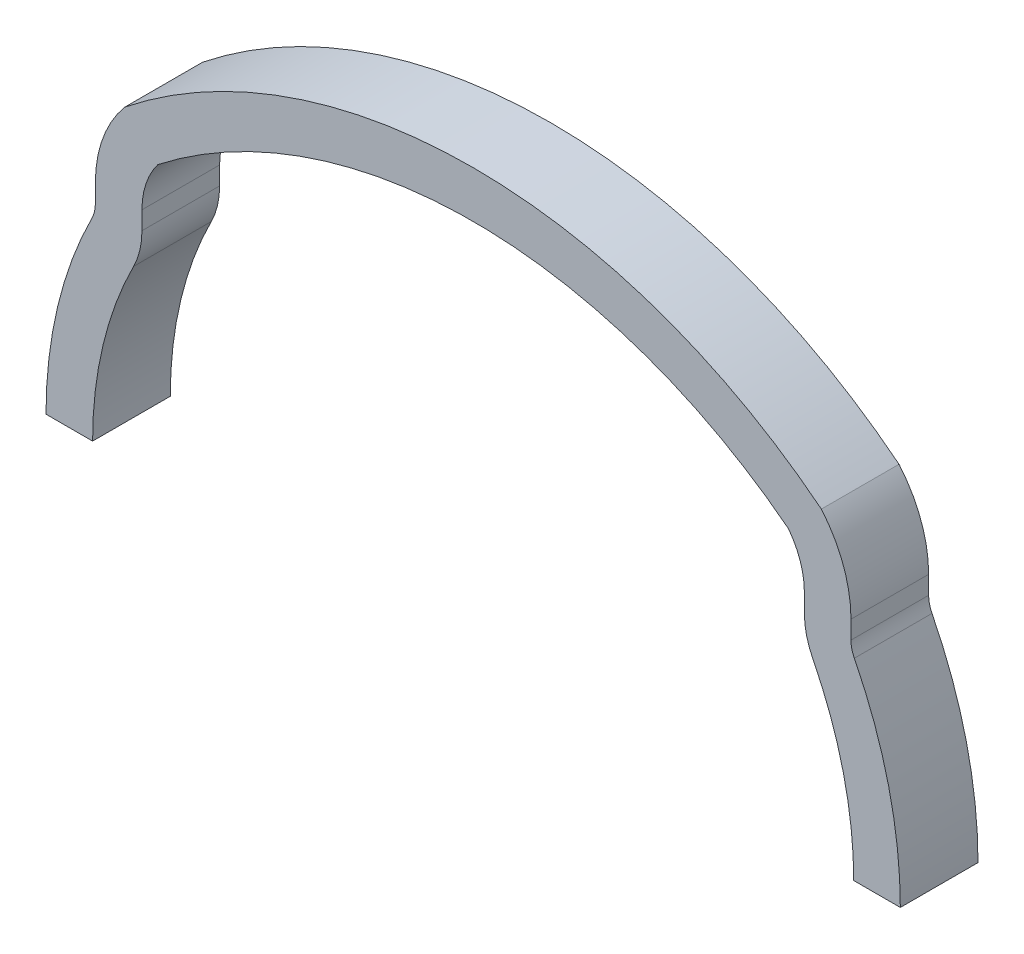
ISO-10303-21;
HEADER;
FILE_DESCRIPTION(('STEP AP214'),'2;1');
FILE_NAME('part.step','',(''),(''),'','','');
FILE_SCHEMA(('AUTOMOTIVE_DESIGN { 1 0 10303 214 1 1 1 1 }'));
ENDSEC;
DATA;
#1=APPLICATION_CONTEXT('core data for automotive mechanical design processes');
#2=APPLICATION_PROTOCOL_DEFINITION('international standard','automotive_design',2000,#1);
#3=PRODUCT_CONTEXT('',#1,'mechanical');
#4=PRODUCT('Part','Part','',(#3));
#5=PRODUCT_RELATED_PRODUCT_CATEGORY('part','',(#4));
#6=PRODUCT_DEFINITION_FORMATION('','',#4);
#7=PRODUCT_DEFINITION_CONTEXT('part definition',#1,'design');
#8=PRODUCT_DEFINITION('design','',#6,#7);
#9=PRODUCT_DEFINITION_SHAPE('','',#8);
#10=(LENGTH_UNIT() NAMED_UNIT(*) SI_UNIT(.MILLI.,.METRE.));
#11=(NAMED_UNIT(*) PLANE_ANGLE_UNIT() SI_UNIT($,.RADIAN.));
#12=(NAMED_UNIT(*) SI_UNIT($,.STERADIAN.) SOLID_ANGLE_UNIT());
#13=UNCERTAINTY_MEASURE_WITH_UNIT(LENGTH_MEASURE(1.E-05),#10,'distance_accuracy_value','');
#14=(GEOMETRIC_REPRESENTATION_CONTEXT(3) GLOBAL_UNCERTAINTY_ASSIGNED_CONTEXT((#13)) GLOBAL_UNIT_ASSIGNED_CONTEXT((#10,
#11,#12)) REPRESENTATION_CONTEXT('',''));
#15=CARTESIAN_POINT('',(0.,0.,0.));
#16=DIRECTION('',(0.,0.,1.));
#17=DIRECTION('',(1.,0.,0.));
#18=AXIS2_PLACEMENT_3D('',#15,#16,#17);
#19=CARTESIAN_POINT('',(16.3230769230769,14.4852505589068,5.));
#20=DIRECTION('',(0.,0.,-1.));
#21=DIRECTION('',(-1.,0.,0.));
#22=AXIS2_PLACEMENT_3D('',#19,#20,#21);
#23=CYLINDRICAL_SURFACE('',#22,7.99999999999999);
#24=CARTESIAN_POINT('',(16.3230769230769,14.4852505589068,0.));
#25=DIRECTION('',(0.,0.,1.));
#26=DIRECTION('',(-1.,0.,0.));
#27=AXIS2_PLACEMENT_3D('',#24,#25,#26);
#28=CIRCLE('',#27,7.99999999999999);
#29=CARTESIAN_POINT('',(24.3230769230769,14.4852505589068,0.));
#30=VERTEX_POINT('',#29);
#31=CARTESIAN_POINT('',(22.4158573499299,19.6696528070119,0.));
#32=VERTEX_POINT('',#31);
#33=EDGE_CURVE('E212',#30,#32,#28,.T.);
#34=ORIENTED_EDGE('',*,*,#33,.T.);
#35=DIRECTION('',(0.,0.,-1.));
#36=VECTOR('',#35,1.);
#37=CARTESIAN_POINT('',(22.4158573499299,19.6696528070119,5.));
#38=LINE('',#37,#36);
#39=CARTESIAN_POINT('',(22.4158573499299,19.6696528070119,5.));
#40=VERTEX_POINT('',#39);
#41=EDGE_CURVE('E11',#40,#32,#38,.T.);
#42=ORIENTED_EDGE('',*,*,#41,.F.);
#43=CARTESIAN_POINT('',(16.3230769230769,14.4852505589068,5.));
#44=DIRECTION('',(0.,0.,1.));
#45=DIRECTION('',(-1.,0.,0.));
#46=AXIS2_PLACEMENT_3D('',#43,#44,#45);
#47=CIRCLE('',#46,7.99999999999999);
#48=CARTESIAN_POINT('',(24.3230769230769,14.4852505589068,5.));
#49=VERTEX_POINT('',#48);
#50=EDGE_CURVE('E271',#49,#40,#47,.T.);
#51=ORIENTED_EDGE('',*,*,#50,.F.);
#52=DIRECTION('',(0.,0.,-1.));
#53=VECTOR('',#52,1.);
#54=CARTESIAN_POINT('',(24.3230769230769,14.4852505589068,5.));
#55=LINE('',#54,#53);
#56=EDGE_CURVE('E208',#49,#30,#55,.T.);
#57=ORIENTED_EDGE('',*,*,#56,.T.);
#58=EDGE_LOOP('',(#34,#42,#51,#57));
#59=FACE_BOUND('',#58,.T.);
#60=ADVANCED_FACE('F39',(#59),#23,.T.);
#61=CARTESIAN_POINT('',(0.,-8.5,5.));
#62=DIRECTION('',(0.,0.,-1.));
#63=DIRECTION('',(-1.,0.,0.));
#64=AXIS2_PLACEMENT_3D('',#61,#62,#63);
#65=CYLINDRICAL_SURFACE('',#64,36.);
#66=CARTESIAN_POINT('',(0.,-8.5,0.));
#67=DIRECTION('',(0.,0.,1.));
#68=DIRECTION('',(1.,0.,0.));
#69=AXIS2_PLACEMENT_3D('',#66,#67,#68);
#70=CIRCLE('',#69,36.);
#71=CARTESIAN_POINT('',(-22.4158573499299,19.6696528070119,0.));
#72=VERTEX_POINT('',#71);
#73=EDGE_CURVE('E216',#32,#72,#70,.T.);
#74=ORIENTED_EDGE('',*,*,#73,.T.);
#75=DIRECTION('',(0.,0.,-1.));
#76=VECTOR('',#75,1.);
#77=CARTESIAN_POINT('',(-22.4158573499299,19.6696528070119,5.));
#78=LINE('',#77,#76);
#79=CARTESIAN_POINT('',(-22.4158573499299,19.6696528070119,5.));
#80=VERTEX_POINT('',#79);
#81=EDGE_CURVE('E48',#80,#72,#78,.T.);
#82=ORIENTED_EDGE('',*,*,#81,.F.);
#83=CARTESIAN_POINT('',(0.,-8.5,5.));
#84=DIRECTION('',(0.,0.,1.));
#85=DIRECTION('',(-1.,0.,0.));
#86=AXIS2_PLACEMENT_3D('',#83,#84,#85);
#87=CIRCLE('',#86,36.);
#88=EDGE_CURVE('E135',#40,#80,#87,.T.);
#89=ORIENTED_EDGE('',*,*,#88,.F.);
#90=ORIENTED_EDGE('',*,*,#41,.T.);
#91=EDGE_LOOP('',(#74,#82,#89,#90));
#92=FACE_BOUND('',#91,.T.);
#93=ADVANCED_FACE('F421',(#92),#65,.T.);
#94=CARTESIAN_POINT('',(-16.3230769230769,14.4852505589068,5.));
#95=DIRECTION('',(0.,0.,-1.));
#96=DIRECTION('',(-1.,0.,0.));
#97=AXIS2_PLACEMENT_3D('',#94,#95,#96);
#98=CYLINDRICAL_SURFACE('',#97,7.99999999999999);
#99=CARTESIAN_POINT('',(-16.3230769230769,14.4852505589068,0.));
#100=DIRECTION('',(0.,0.,1.));
#101=DIRECTION('',(1.,0.,0.));
#102=AXIS2_PLACEMENT_3D('',#99,#100,#101);
#103=CIRCLE('',#102,7.99999999999999);
#104=CARTESIAN_POINT('',(-24.3230769230769,14.4852505589068,0.));
#105=VERTEX_POINT('',#104);
#106=EDGE_CURVE('E219',#72,#105,#103,.T.);
#107=ORIENTED_EDGE('',*,*,#106,.T.);
#108=DIRECTION('',(0.,0.,-1.));
#109=VECTOR('',#108,1.);
#110=CARTESIAN_POINT('',(-24.3230769230769,14.4852505589068,5.));
#111=LINE('',#110,#109);
#112=CARTESIAN_POINT('',(-24.3230769230769,14.4852505589068,5.));
#113=VERTEX_POINT('',#112);
#114=EDGE_CURVE('E330',#113,#105,#111,.T.);
#115=ORIENTED_EDGE('',*,*,#114,.F.);
#116=CARTESIAN_POINT('',(-16.3230769230769,14.4852505589068,5.));
#117=DIRECTION('',(0.,0.,1.));
#118=DIRECTION('',(1.,0.,0.));
#119=AXIS2_PLACEMENT_3D('',#116,#117,#118);
#120=CIRCLE('',#119,7.99999999999999);
#121=EDGE_CURVE('E340',#80,#113,#120,.T.);
#122=ORIENTED_EDGE('',*,*,#121,.F.);
#123=ORIENTED_EDGE('',*,*,#81,.T.);
#124=EDGE_LOOP('',(#107,#115,#122,#123));
#125=FACE_BOUND('',#124,.T.);
#126=ADVANCED_FACE('F338',(#125),#98,.T.);
#127=CARTESIAN_POINT('',(-24.3230769230769,14.4852505589068,5.));
#128=DIRECTION('',(1.,0.,0.));
#129=DIRECTION('',(0.,1.,0.));
#130=AXIS2_PLACEMENT_3D('',#127,#128,#129);
#131=PLANE('',#130);
#132=DIRECTION('',(0.,-1.,0.));
#133=VECTOR('',#132,1.);
#134=CARTESIAN_POINT('',(-24.3230769230769,14.4852505589068,0.));
#135=LINE('',#134,#133);
#136=CARTESIAN_POINT('',(-24.3230769230769,13.3171176048639,0.));
#137=VERTEX_POINT('',#136);
#138=EDGE_CURVE('E222',#105,#137,#135,.T.);
#139=ORIENTED_EDGE('',*,*,#138,.T.);
#140=DIRECTION('',(0.,0.,-1.));
#141=VECTOR('',#140,1.);
#142=CARTESIAN_POINT('',(-24.3230769230769,13.3171176048639,5.));
#143=LINE('',#142,#141);
#144=CARTESIAN_POINT('',(-24.3230769230769,13.3171176048639,5.));
#145=VERTEX_POINT('',#144);
#146=EDGE_CURVE('E326',#145,#137,#143,.T.);
#147=ORIENTED_EDGE('',*,*,#146,.F.);
#148=DIRECTION('',(0.,-1.,0.));
#149=VECTOR('',#148,1.);
#150=CARTESIAN_POINT('',(-24.3230769230769,14.4852505589068,5.));
#151=LINE('',#150,#149);
#152=EDGE_CURVE('E359',#113,#145,#151,.T.);
#153=ORIENTED_EDGE('',*,*,#152,.F.);
#154=ORIENTED_EDGE('',*,*,#114,.T.);
#155=EDGE_LOOP('',(#139,#147,#153,#154));
#156=FACE_BOUND('',#155,.T.);
#157=ADVANCED_FACE('F349',(#156),#131,.F.);
#158=CARTESIAN_POINT('',(-26.3230769230769,13.3171176048639,5.));
#159=DIRECTION('',(0.,0.,-1.));
#160=DIRECTION('',(-1.,0.,0.));
#161=AXIS2_PLACEMENT_3D('',#158,#159,#160);
#162=CYLINDRICAL_SURFACE('',#161,2.);
#163=CARTESIAN_POINT('',(-26.3230769230769,13.3171176048639,0.));
#164=DIRECTION('',(0.,0.,-1.));
#165=DIRECTION('',(-1.,0.,0.));
#166=AXIS2_PLACEMENT_3D('',#163,#164,#165);
#167=CIRCLE('',#166,2.);
#168=CARTESIAN_POINT('',(-24.5384615384616,12.4142621740256,0.));
#169=VERTEX_POINT('',#168);
#170=EDGE_CURVE('E225',#137,#169,#167,.T.);
#171=ORIENTED_EDGE('',*,*,#170,.T.);
#172=DIRECTION('',(0.,0.,-1.));
#173=VECTOR('',#172,1.);
#174=CARTESIAN_POINT('',(-24.5384615384616,12.4142621740256,5.));
#175=LINE('',#174,#173);
#176=CARTESIAN_POINT('',(-24.5384615384616,12.4142621740256,5.));
#177=VERTEX_POINT('',#176);
#178=EDGE_CURVE('E322',#177,#169,#175,.T.);
#179=ORIENTED_EDGE('',*,*,#178,.F.);
#180=CARTESIAN_POINT('',(-26.3230769230769,13.3171176048639,5.));
#181=DIRECTION('',(0.,0.,-1.));
#182=DIRECTION('',(-1.,0.,0.));
#183=AXIS2_PLACEMENT_3D('',#180,#181,#182);
#184=CIRCLE('',#183,2.);
#185=EDGE_CURVE('E355',#145,#177,#184,.T.);
#186=ORIENTED_EDGE('',*,*,#185,.F.);
#187=ORIENTED_EDGE('',*,*,#146,.T.);
#188=EDGE_LOOP('',(#171,#179,#186,#187));
#189=FACE_BOUND('',#188,.T.);
#190=ADVANCED_FACE('F353',(#189),#162,.F.);
#191=CARTESIAN_POINT('',(0.,0.,5.));
#192=DIRECTION('',(0.,0.,-1.));
#193=DIRECTION('',(-1.,0.,0.));
#194=AXIS2_PLACEMENT_3D('',#191,#192,#193);
#195=CYLINDRICAL_SURFACE('',#194,27.5);
#196=CARTESIAN_POINT('',(0.,0.,0.));
#197=DIRECTION('',(0.,0.,1.));
#198=DIRECTION('',(1.,0.,0.));
#199=AXIS2_PLACEMENT_3D('',#196,#197,#198);
#200=CIRCLE('',#199,27.5);
#201=CARTESIAN_POINT('',(-27.5,0.,0.));
#202=VERTEX_POINT('',#201);
#203=EDGE_CURVE('E228',#169,#202,#200,.T.);
#204=ORIENTED_EDGE('',*,*,#203,.T.);
#205=DIRECTION('',(0.,0.,-1.));
#206=VECTOR('',#205,1.);
#207=CARTESIAN_POINT('',(-27.5,0.,5.));
#208=LINE('',#207,#206);
#209=CARTESIAN_POINT('',(-27.5,0.,5.));
#210=VERTEX_POINT('',#209);
#211=EDGE_CURVE('E318',#210,#202,#208,.T.);
#212=ORIENTED_EDGE('',*,*,#211,.F.);
#213=CARTESIAN_POINT('',(0.,0.,5.));
#214=DIRECTION('',(0.,0.,1.));
#215=DIRECTION('',(1.,0.,0.));
#216=AXIS2_PLACEMENT_3D('',#213,#214,#215);
#217=CIRCLE('',#216,27.5);
#218=EDGE_CURVE('E358',#177,#210,#217,.T.);
#219=ORIENTED_EDGE('',*,*,#218,.F.);
#220=ORIENTED_EDGE('',*,*,#178,.T.);
#221=EDGE_LOOP('',(#204,#212,#219,#220));
#222=FACE_BOUND('',#221,.T.);
#223=ADVANCED_FACE('F434',(#222),#195,.T.);
#224=CARTESIAN_POINT('',(-27.5,0.,5.));
#225=DIRECTION('',(0.,1.,0.));
#226=DIRECTION('',(-1.,0.,0.));
#227=AXIS2_PLACEMENT_3D('',#224,#225,#226);
#228=PLANE('',#227);
#229=DIRECTION('',(1.,0.,0.));
#230=VECTOR('',#229,1.);
#231=CARTESIAN_POINT('',(-27.5,0.,0.));
#232=LINE('',#231,#230);
#233=CARTESIAN_POINT('',(-24.5,0.,0.));
#234=VERTEX_POINT('',#233);
#235=EDGE_CURVE('E231',#202,#234,#232,.T.);
#236=ORIENTED_EDGE('',*,*,#235,.T.);
#237=DIRECTION('',(0.,0.,-1.));
#238=VECTOR('',#237,1.);
#239=CARTESIAN_POINT('',(-24.5,0.,5.));
#240=LINE('',#239,#238);
#241=CARTESIAN_POINT('',(-24.5,0.,5.));
#242=VERTEX_POINT('',#241);
#243=EDGE_CURVE('E314',#242,#234,#240,.T.);
#244=ORIENTED_EDGE('',*,*,#243,.F.);
#245=DIRECTION('',(1.,0.,0.));
#246=VECTOR('',#245,1.);
#247=CARTESIAN_POINT('',(-27.5,0.,5.));
#248=LINE('',#247,#246);
#249=EDGE_CURVE('E363',#210,#242,#248,.T.);
#250=ORIENTED_EDGE('',*,*,#249,.F.);
#251=ORIENTED_EDGE('',*,*,#211,.T.);
#252=EDGE_LOOP('',(#236,#244,#250,#251));
#253=FACE_BOUND('',#252,.T.);
#254=ADVANCED_FACE('F437',(#253),#228,.F.);
#255=CARTESIAN_POINT('',(0.,0.,5.));
#256=DIRECTION('',(0.,0.,-1.));
#257=DIRECTION('',(-1.,0.,0.));
#258=AXIS2_PLACEMENT_3D('',#255,#256,#257);
#259=CYLINDRICAL_SURFACE('',#258,24.5);
#260=CARTESIAN_POINT('',(0.,0.,0.));
#261=DIRECTION('',(0.,0.,-1.));
#262=DIRECTION('',(1.,0.,0.));
#263=AXIS2_PLACEMENT_3D('',#260,#261,#262);
#264=CIRCLE('',#263,24.5);
#265=CARTESIAN_POINT('',(-21.8615384615385,11.0599790277683,0.));
#266=VERTEX_POINT('',#265);
#267=EDGE_CURVE('E234',#234,#266,#264,.T.);
#268=ORIENTED_EDGE('',*,*,#267,.T.);
#269=DIRECTION('',(0.,0.,-1.));
#270=VECTOR('',#269,1.);
#271=CARTESIAN_POINT('',(-21.8615384615385,11.0599790277683,5.));
#272=LINE('',#271,#270);
#273=CARTESIAN_POINT('',(-21.8615384615385,11.0599790277683,5.));
#274=VERTEX_POINT('',#273);
#275=EDGE_CURVE('E310',#274,#266,#272,.T.);
#276=ORIENTED_EDGE('',*,*,#275,.F.);
#277=CARTESIAN_POINT('',(0.,0.,5.));
#278=DIRECTION('',(0.,0.,-1.));
#279=DIRECTION('',(1.,0.,0.));
#280=AXIS2_PLACEMENT_3D('',#277,#278,#279);
#281=CIRCLE('',#280,24.5);
#282=EDGE_CURVE('E370',#242,#274,#281,.T.);
#283=ORIENTED_EDGE('',*,*,#282,.F.);
#284=ORIENTED_EDGE('',*,*,#243,.T.);
#285=EDGE_LOOP('',(#268,#276,#283,#284));
#286=FACE_BOUND('',#285,.T.);
#287=ADVANCED_FACE('F441',(#286),#259,.F.);
#288=CARTESIAN_POINT('',(-26.3230769230769,13.3171176048639,5.));
#289=DIRECTION('',(0.,0.,-1.));
#290=DIRECTION('',(-1.,0.,0.));
#291=AXIS2_PLACEMENT_3D('',#288,#289,#290);
#292=CYLINDRICAL_SURFACE('',#291,5.);
#293=CARTESIAN_POINT('',(-26.3230769230769,13.3171176048639,0.));
#294=DIRECTION('',(0.,0.,1.));
#295=DIRECTION('',(-1.,0.,0.));
#296=AXIS2_PLACEMENT_3D('',#293,#294,#295);
#297=CIRCLE('',#296,5.);
#298=CARTESIAN_POINT('',(-21.3230769230769,13.3171176048639,0.));
#299=VERTEX_POINT('',#298);
#300=EDGE_CURVE('E237',#266,#299,#297,.T.);
#301=ORIENTED_EDGE('',*,*,#300,.T.);
#302=DIRECTION('',(0.,0.,-1.));
#303=VECTOR('',#302,1.);
#304=CARTESIAN_POINT('',(-21.3230769230769,13.3171176048639,5.));
#305=LINE('',#304,#303);
#306=CARTESIAN_POINT('',(-21.3230769230769,13.3171176048639,5.));
#307=VERTEX_POINT('',#306);
#308=EDGE_CURVE('E306',#307,#299,#305,.T.);
#309=ORIENTED_EDGE('',*,*,#308,.F.);
#310=CARTESIAN_POINT('',(-26.3230769230769,13.3171176048639,5.));
#311=DIRECTION('',(0.,0.,1.));
#312=DIRECTION('',(-1.,0.,0.));
#313=AXIS2_PLACEMENT_3D('',#310,#311,#312);
#314=CIRCLE('',#313,5.);
#315=EDGE_CURVE('E373',#274,#307,#314,.T.);
#316=ORIENTED_EDGE('',*,*,#315,.F.);
#317=ORIENTED_EDGE('',*,*,#275,.T.);
#318=EDGE_LOOP('',(#301,#309,#316,#317));
#319=FACE_BOUND('',#318,.T.);
#320=ADVANCED_FACE('F445',(#319),#292,.T.);
#321=CARTESIAN_POINT('',(-21.3230769230769,14.4852505589068,5.));
#322=DIRECTION('',(-1.,0.,0.));
#323=DIRECTION('',(0.,-1.,0.));
#324=AXIS2_PLACEMENT_3D('',#321,#322,#323);
#325=PLANE('',#324);
#326=DIRECTION('',(0.,1.,0.));
#327=VECTOR('',#326,1.);
#328=CARTESIAN_POINT('',(-21.3230769230769,14.4852505589068,0.));
#329=LINE('',#328,#327);
#330=CARTESIAN_POINT('',(-21.3230769230769,14.4852505589068,0.));
#331=VERTEX_POINT('',#330);
#332=EDGE_CURVE('E240',#299,#331,#329,.T.);
#333=ORIENTED_EDGE('',*,*,#332,.T.);
#334=DIRECTION('',(0.,0.,-1.));
#335=VECTOR('',#334,1.);
#336=CARTESIAN_POINT('',(-21.3230769230769,14.4852505589068,5.));
#337=LINE('',#336,#335);
#338=CARTESIAN_POINT('',(-21.3230769230769,14.4852505589068,5.));
#339=VERTEX_POINT('',#338);
#340=EDGE_CURVE('E302',#339,#331,#337,.T.);
#341=ORIENTED_EDGE('',*,*,#340,.F.);
#342=DIRECTION('',(0.,1.,0.));
#343=VECTOR('',#342,1.);
#344=CARTESIAN_POINT('',(-21.3230769230769,14.4852505589068,5.));
#345=LINE('',#344,#343);
#346=EDGE_CURVE('E376',#307,#339,#345,.T.);
#347=ORIENTED_EDGE('',*,*,#346,.F.);
#348=ORIENTED_EDGE('',*,*,#308,.T.);
#349=EDGE_LOOP('',(#333,#341,#347,#348));
#350=FACE_BOUND('',#349,.T.);
#351=ADVANCED_FACE('F449',(#350),#325,.F.);
#352=CARTESIAN_POINT('',(-16.3230769230769,14.4852505589068,5.));
#353=DIRECTION('',(0.,0.,-1.));
#354=DIRECTION('',(-1.,0.,0.));
#355=AXIS2_PLACEMENT_3D('',#352,#353,#354);
#356=CYLINDRICAL_SURFACE('',#355,5.);
#357=CARTESIAN_POINT('',(-16.3230769230769,14.4852505589068,0.));
#358=DIRECTION('',(0.,0.,-1.));
#359=DIRECTION('',(1.,0.,0.));
#360=AXIS2_PLACEMENT_3D('',#357,#358,#359);
#361=CIRCLE('',#360,5.);
#362=CARTESIAN_POINT('',(-20.2967620018153,17.5200202198551,0.));
#363=VERTEX_POINT('',#362);
#364=EDGE_CURVE('E243',#331,#363,#361,.T.);
#365=ORIENTED_EDGE('',*,*,#364,.T.);
#366=DIRECTION('',(0.,0.,-1.));
#367=VECTOR('',#366,1.);
#368=CARTESIAN_POINT('',(-20.2967620018153,17.5200202198551,5.));
#369=LINE('',#368,#367);
#370=CARTESIAN_POINT('',(-20.2967620018153,17.5200202198551,5.));
#371=VERTEX_POINT('',#370);
#372=EDGE_CURVE('E298',#371,#363,#369,.T.);
#373=ORIENTED_EDGE('',*,*,#372,.F.);
#374=CARTESIAN_POINT('',(-16.3230769230769,14.4852505589068,5.));
#375=DIRECTION('',(0.,0.,-1.));
#376=DIRECTION('',(1.,0.,0.));
#377=AXIS2_PLACEMENT_3D('',#374,#375,#376);
#378=CIRCLE('',#377,5.);
#379=EDGE_CURVE('E379',#339,#371,#378,.T.);
#380=ORIENTED_EDGE('',*,*,#379,.F.);
#381=ORIENTED_EDGE('',*,*,#340,.T.);
#382=EDGE_LOOP('',(#365,#373,#380,#381));
#383=FACE_BOUND('',#382,.T.);
#384=ADVANCED_FACE('F453',(#383),#356,.F.);
#385=CARTESIAN_POINT('',(0.,-8.5,5.));
#386=DIRECTION('',(0.,0.,-1.));
#387=DIRECTION('',(-1.,0.,0.));
#388=AXIS2_PLACEMENT_3D('',#385,#386,#387);
#389=CYLINDRICAL_SURFACE('',#388,33.);
#390=CARTESIAN_POINT('',(0.,-8.5,0.));
#391=DIRECTION('',(0.,0.,-1.));
#392=DIRECTION('',(-1.,0.,0.));
#393=AXIS2_PLACEMENT_3D('',#390,#391,#392);
#394=CIRCLE('',#393,33.);
#395=CARTESIAN_POINT('',(20.2967620018153,17.5200202198551,0.));
#396=VERTEX_POINT('',#395);
#397=EDGE_CURVE('E247',#363,#396,#394,.T.);
#398=ORIENTED_EDGE('',*,*,#397,.T.);
#399=DIRECTION('',(0.,0.,-1.));
#400=VECTOR('',#399,1.);
#401=CARTESIAN_POINT('',(20.2967620018153,17.5200202198551,5.));
#402=LINE('',#401,#400);
#403=CARTESIAN_POINT('',(20.2967620018153,17.5200202198551,5.));
#404=VERTEX_POINT('',#403);
#405=EDGE_CURVE('E294',#404,#396,#402,.T.);
#406=ORIENTED_EDGE('',*,*,#405,.F.);
#407=CARTESIAN_POINT('',(0.,-8.5,5.));
#408=DIRECTION('',(0.,0.,-1.));
#409=DIRECTION('',(1.,0.,0.));
#410=AXIS2_PLACEMENT_3D('',#407,#408,#409);
#411=CIRCLE('',#410,33.);
#412=EDGE_CURVE('E382',#371,#404,#411,.T.);
#413=ORIENTED_EDGE('',*,*,#412,.F.);
#414=ORIENTED_EDGE('',*,*,#372,.T.);
#415=EDGE_LOOP('',(#398,#406,#413,#414));
#416=FACE_BOUND('',#415,.T.);
#417=ADVANCED_FACE('F457',(#416),#389,.F.);
#418=CARTESIAN_POINT('',(16.3230769230769,14.4852505589068,5.));
#419=DIRECTION('',(0.,0.,-1.));
#420=DIRECTION('',(-1.,0.,0.));
#421=AXIS2_PLACEMENT_3D('',#418,#419,#420);
#422=CYLINDRICAL_SURFACE('',#421,5.);
#423=CARTESIAN_POINT('',(16.3230769230769,14.4852505589068,0.));
#424=DIRECTION('',(0.,0.,-1.));
#425=DIRECTION('',(-1.,0.,0.));
#426=AXIS2_PLACEMENT_3D('',#423,#424,#425);
#427=CIRCLE('',#426,5.);
#428=CARTESIAN_POINT('',(21.3230769230769,14.4852505589068,0.));
#429=VERTEX_POINT('',#428);
#430=EDGE_CURVE('E250',#396,#429,#427,.T.);
#431=ORIENTED_EDGE('',*,*,#430,.T.);
#432=DIRECTION('',(0.,0.,-1.));
#433=VECTOR('',#432,1.);
#434=CARTESIAN_POINT('',(21.3230769230769,14.4852505589068,5.));
#435=LINE('',#434,#433);
#436=CARTESIAN_POINT('',(21.3230769230769,14.4852505589068,5.));
#437=VERTEX_POINT('',#436);
#438=EDGE_CURVE('E290',#437,#429,#435,.T.);
#439=ORIENTED_EDGE('',*,*,#438,.F.);
#440=CARTESIAN_POINT('',(16.3230769230769,14.4852505589068,5.));
#441=DIRECTION('',(0.,0.,-1.));
#442=DIRECTION('',(-1.,0.,0.));
#443=AXIS2_PLACEMENT_3D('',#440,#441,#442);
#444=CIRCLE('',#443,5.);
#445=EDGE_CURVE('E385',#404,#437,#444,.T.);
#446=ORIENTED_EDGE('',*,*,#445,.F.);
#447=ORIENTED_EDGE('',*,*,#405,.T.);
#448=EDGE_LOOP('',(#431,#439,#446,#447));
#449=FACE_BOUND('',#448,.T.);
#450=ADVANCED_FACE('F461',(#449),#422,.F.);
#451=CARTESIAN_POINT('',(21.3230769230769,14.4852505589068,5.));
#452=DIRECTION('',(1.,0.,0.));
#453=DIRECTION('',(0.,1.,0.));
#454=AXIS2_PLACEMENT_3D('',#451,#452,#453);
#455=PLANE('',#454);
#456=DIRECTION('',(0.,-1.,0.));
#457=VECTOR('',#456,1.);
#458=CARTESIAN_POINT('',(21.3230769230769,14.4852505589068,0.));
#459=LINE('',#458,#457);
#460=CARTESIAN_POINT('',(21.3230769230769,13.3171176048639,0.));
#461=VERTEX_POINT('',#460);
#462=EDGE_CURVE('E253',#429,#461,#459,.T.);
#463=ORIENTED_EDGE('',*,*,#462,.T.);
#464=DIRECTION('',(0.,0.,-1.));
#465=VECTOR('',#464,1.);
#466=CARTESIAN_POINT('',(21.3230769230769,13.3171176048639,5.));
#467=LINE('',#466,#465);
#468=CARTESIAN_POINT('',(21.3230769230769,13.3171176048639,5.));
#469=VERTEX_POINT('',#468);
#470=EDGE_CURVE('E286',#469,#461,#467,.T.);
#471=ORIENTED_EDGE('',*,*,#470,.F.);
#472=DIRECTION('',(0.,-1.,0.));
#473=VECTOR('',#472,1.);
#474=CARTESIAN_POINT('',(21.3230769230769,14.4852505589068,5.));
#475=LINE('',#474,#473);
#476=EDGE_CURVE('E388',#437,#469,#475,.T.);
#477=ORIENTED_EDGE('',*,*,#476,.F.);
#478=ORIENTED_EDGE('',*,*,#438,.T.);
#479=EDGE_LOOP('',(#463,#471,#477,#478));
#480=FACE_BOUND('',#479,.T.);
#481=ADVANCED_FACE('F465',(#480),#455,.F.);
#482=CARTESIAN_POINT('',(26.3230769230769,13.3171176048639,5.));
#483=DIRECTION('',(0.,0.,-1.));
#484=DIRECTION('',(-1.,0.,0.));
#485=AXIS2_PLACEMENT_3D('',#482,#483,#484);
#486=CYLINDRICAL_SURFACE('',#485,5.);
#487=CARTESIAN_POINT('',(26.3230769230769,13.3171176048639,0.));
#488=DIRECTION('',(0.,0.,1.));
#489=DIRECTION('',(1.,0.,0.));
#490=AXIS2_PLACEMENT_3D('',#487,#488,#489);
#491=CIRCLE('',#490,5.);
#492=CARTESIAN_POINT('',(21.8615384615385,11.0599790277683,0.));
#493=VERTEX_POINT('',#492);
#494=EDGE_CURVE('E256',#461,#493,#491,.T.);
#495=ORIENTED_EDGE('',*,*,#494,.T.);
#496=DIRECTION('',(0.,0.,-1.));
#497=VECTOR('',#496,1.);
#498=CARTESIAN_POINT('',(21.8615384615385,11.0599790277683,5.));
#499=LINE('',#498,#497);
#500=CARTESIAN_POINT('',(21.8615384615385,11.0599790277683,5.));
#501=VERTEX_POINT('',#500);
#502=EDGE_CURVE('E282',#501,#493,#499,.T.);
#503=ORIENTED_EDGE('',*,*,#502,.F.);
#504=CARTESIAN_POINT('',(26.3230769230769,13.3171176048639,5.));
#505=DIRECTION('',(0.,0.,1.));
#506=DIRECTION('',(1.,0.,0.));
#507=AXIS2_PLACEMENT_3D('',#504,#505,#506);
#508=CIRCLE('',#507,5.);
#509=EDGE_CURVE('E391',#469,#501,#508,.T.);
#510=ORIENTED_EDGE('',*,*,#509,.F.);
#511=ORIENTED_EDGE('',*,*,#470,.T.);
#512=EDGE_LOOP('',(#495,#503,#510,#511));
#513=FACE_BOUND('',#512,.T.);
#514=ADVANCED_FACE('F469',(#513),#486,.T.);
#515=CARTESIAN_POINT('',(0.,0.,5.));
#516=DIRECTION('',(0.,0.,-1.));
#517=DIRECTION('',(-1.,0.,0.));
#518=AXIS2_PLACEMENT_3D('',#515,#516,#517);
#519=CYLINDRICAL_SURFACE('',#518,24.5);
#520=CARTESIAN_POINT('',(0.,0.,0.));
#521=DIRECTION('',(0.,0.,-1.));
#522=DIRECTION('',(-1.,0.,0.));
#523=AXIS2_PLACEMENT_3D('',#520,#521,#522);
#524=CIRCLE('',#523,24.5);
#525=CARTESIAN_POINT('',(24.5,0.,0.));
#526=VERTEX_POINT('',#525);
#527=EDGE_CURVE('E259',#493,#526,#524,.T.);
#528=ORIENTED_EDGE('',*,*,#527,.T.);
#529=DIRECTION('',(0.,0.,-1.));
#530=VECTOR('',#529,1.);
#531=CARTESIAN_POINT('',(24.5,0.,5.));
#532=LINE('',#531,#530);
#533=CARTESIAN_POINT('',(24.5,0.,5.));
#534=VERTEX_POINT('',#533);
#535=EDGE_CURVE('E278',#534,#526,#532,.T.);
#536=ORIENTED_EDGE('',*,*,#535,.F.);
#537=CARTESIAN_POINT('',(0.,0.,5.));
#538=DIRECTION('',(0.,0.,-1.));
#539=DIRECTION('',(-1.,0.,0.));
#540=AXIS2_PLACEMENT_3D('',#537,#538,#539);
#541=CIRCLE('',#540,24.5);
#542=EDGE_CURVE('E394',#501,#534,#541,.T.);
#543=ORIENTED_EDGE('',*,*,#542,.F.);
#544=ORIENTED_EDGE('',*,*,#502,.T.);
#545=EDGE_LOOP('',(#528,#536,#543,#544));
#546=FACE_BOUND('',#545,.T.);
#547=ADVANCED_FACE('F402',(#546),#519,.F.);
#548=CARTESIAN_POINT('',(27.5,0.,5.));
#549=DIRECTION('',(0.,1.,0.));
#550=DIRECTION('',(-1.,0.,0.));
#551=AXIS2_PLACEMENT_3D('',#548,#549,#550);
#552=PLANE('',#551);
#553=DIRECTION('',(1.,0.,0.));
#554=VECTOR('',#553,1.);
#555=CARTESIAN_POINT('',(27.5,0.,0.));
#556=LINE('',#555,#554);
#557=CARTESIAN_POINT('',(27.5,0.,0.));
#558=VERTEX_POINT('',#557);
#559=EDGE_CURVE('E262',#526,#558,#556,.T.);
#560=ORIENTED_EDGE('',*,*,#559,.T.);
#561=DIRECTION('',(0.,0.,-1.));
#562=VECTOR('',#561,1.);
#563=CARTESIAN_POINT('',(27.5,0.,5.));
#564=LINE('',#563,#562);
#565=CARTESIAN_POINT('',(27.5,0.,5.));
#566=VERTEX_POINT('',#565);
#567=EDGE_CURVE('E201',#566,#558,#564,.T.);
#568=ORIENTED_EDGE('',*,*,#567,.F.);
#569=DIRECTION('',(1.,0.,0.));
#570=VECTOR('',#569,1.);
#571=CARTESIAN_POINT('',(27.5,0.,5.));
#572=LINE('',#571,#570);
#573=EDGE_CURVE('E190',#534,#566,#572,.T.);
#574=ORIENTED_EDGE('',*,*,#573,.F.);
#575=ORIENTED_EDGE('',*,*,#535,.T.);
#576=EDGE_LOOP('',(#560,#568,#574,#575));
#577=FACE_BOUND('',#576,.T.);
#578=ADVANCED_FACE('F406',(#577),#552,.F.);
#579=CARTESIAN_POINT('',(0.,0.,5.));
#580=DIRECTION('',(0.,0.,-1.));
#581=DIRECTION('',(-1.,0.,0.));
#582=AXIS2_PLACEMENT_3D('',#579,#580,#581);
#583=CYLINDRICAL_SURFACE('',#582,27.5);
#584=CARTESIAN_POINT('',(0.,0.,0.));
#585=DIRECTION('',(0.,0.,1.));
#586=DIRECTION('',(-1.,0.,0.));
#587=AXIS2_PLACEMENT_3D('',#584,#585,#586);
#588=CIRCLE('',#587,27.5);
#589=CARTESIAN_POINT('',(24.5384615384615,12.4142621740256,0.));
#590=VERTEX_POINT('',#589);
#591=EDGE_CURVE('E199',#558,#590,#588,.T.);
#592=ORIENTED_EDGE('',*,*,#591,.T.);
#593=DIRECTION('',(0.,0.,-1.));
#594=VECTOR('',#593,1.);
#595=CARTESIAN_POINT('',(24.5384615384615,12.4142621740256,5.));
#596=LINE('',#595,#594);
#597=CARTESIAN_POINT('',(24.5384615384615,12.4142621740256,5.));
#598=VERTEX_POINT('',#597);
#599=EDGE_CURVE('E196',#598,#590,#596,.T.);
#600=ORIENTED_EDGE('',*,*,#599,.F.);
#601=CARTESIAN_POINT('',(0.,0.,5.));
#602=DIRECTION('',(0.,0.,1.));
#603=DIRECTION('',(-1.,0.,0.));
#604=AXIS2_PLACEMENT_3D('',#601,#602,#603);
#605=CIRCLE('',#604,27.5);
#606=EDGE_CURVE('E184',#566,#598,#605,.T.);
#607=ORIENTED_EDGE('',*,*,#606,.F.);
#608=ORIENTED_EDGE('',*,*,#567,.T.);
#609=EDGE_LOOP('',(#592,#600,#607,#608));
#610=FACE_BOUND('',#609,.T.);
#611=ADVANCED_FACE('F197',(#610),#583,.T.);
#612=CARTESIAN_POINT('',(26.3230769230769,13.3171176048639,5.));
#613=DIRECTION('',(0.,0.,-1.));
#614=DIRECTION('',(-1.,0.,0.));
#615=AXIS2_PLACEMENT_3D('',#612,#613,#614);
#616=CYLINDRICAL_SURFACE('',#615,2.);
#617=CARTESIAN_POINT('',(26.3230769230769,13.3171176048639,0.));
#618=DIRECTION('',(0.,0.,-1.));
#619=DIRECTION('',(1.,0.,0.));
#620=AXIS2_PLACEMENT_3D('',#617,#618,#619);
#621=CIRCLE('',#620,2.);
#622=CARTESIAN_POINT('',(24.3230769230769,13.3171176048639,0.));
#623=VERTEX_POINT('',#622);
#624=EDGE_CURVE('E121',#590,#623,#621,.T.);
#625=ORIENTED_EDGE('',*,*,#624,.T.);
#626=DIRECTION('',(0.,0.,-1.));
#627=VECTOR('',#626,1.);
#628=CARTESIAN_POINT('',(24.3230769230769,13.3171176048639,5.));
#629=LINE('',#628,#627);
#630=CARTESIAN_POINT('',(24.3230769230769,13.3171176048639,5.));
#631=VERTEX_POINT('',#630);
#632=EDGE_CURVE('E202',#631,#623,#629,.T.);
#633=ORIENTED_EDGE('',*,*,#632,.F.);
#634=CARTESIAN_POINT('',(26.3230769230769,13.3171176048639,5.));
#635=DIRECTION('',(0.,0.,-1.));
#636=DIRECTION('',(1.,0.,0.));
#637=AXIS2_PLACEMENT_3D('',#634,#635,#636);
#638=CIRCLE('',#637,2.);
#639=EDGE_CURVE('E188',#598,#631,#638,.T.);
#640=ORIENTED_EDGE('',*,*,#639,.F.);
#641=ORIENTED_EDGE('',*,*,#599,.T.);
#642=EDGE_LOOP('',(#625,#633,#640,#641));
#643=FACE_BOUND('',#642,.T.);
#644=ADVANCED_FACE('F204',(#643),#616,.F.);
#645=CARTESIAN_POINT('',(24.3230769230769,14.4852505589068,5.));
#646=DIRECTION('',(-1.,0.,0.));
#647=DIRECTION('',(0.,-1.,0.));
#648=AXIS2_PLACEMENT_3D('',#645,#646,#647);
#649=PLANE('',#648);
#650=DIRECTION('',(0.,1.,0.));
#651=VECTOR('',#650,1.);
#652=CARTESIAN_POINT('',(24.3230769230769,14.4852505589068,0.));
#653=LINE('',#652,#651);
#654=EDGE_CURVE('E127',#623,#30,#653,.T.);
#655=ORIENTED_EDGE('',*,*,#654,.T.);
#656=ORIENTED_EDGE('',*,*,#56,.F.);
#657=DIRECTION('',(0.,1.,0.));
#658=VECTOR('',#657,1.);
#659=CARTESIAN_POINT('',(24.3230769230769,14.4852505589068,5.));
#660=LINE('',#659,#658);
#661=EDGE_CURVE('E56',#631,#49,#660,.T.);
#662=ORIENTED_EDGE('',*,*,#661,.F.);
#663=ORIENTED_EDGE('',*,*,#632,.T.);
#664=EDGE_LOOP('',(#655,#656,#662,#663));
#665=FACE_BOUND('',#664,.T.);
#666=ADVANCED_FACE('F410',(#665),#649,.F.);
#667=CARTESIAN_POINT('',(16.3230769230769,14.4852505589068,5.));
#668=DIRECTION('',(0.,0.,-1.));
#669=DIRECTION('',(-1.,0.,0.));
#670=AXIS2_PLACEMENT_3D('',#667,#668,#669);
#671=PLANE('',#670);
#672=ORIENTED_EDGE('',*,*,#50,.T.);
#673=ORIENTED_EDGE('',*,*,#88,.T.);
#674=ORIENTED_EDGE('',*,*,#121,.T.);
#675=ORIENTED_EDGE('',*,*,#152,.T.);
#676=ORIENTED_EDGE('',*,*,#185,.T.);
#677=ORIENTED_EDGE('',*,*,#218,.T.);
#678=ORIENTED_EDGE('',*,*,#249,.T.);
#679=ORIENTED_EDGE('',*,*,#282,.T.);
#680=ORIENTED_EDGE('',*,*,#315,.T.);
#681=ORIENTED_EDGE('',*,*,#346,.T.);
#682=ORIENTED_EDGE('',*,*,#379,.T.);
#683=ORIENTED_EDGE('',*,*,#412,.T.);
#684=ORIENTED_EDGE('',*,*,#445,.T.);
#685=ORIENTED_EDGE('',*,*,#476,.T.);
#686=ORIENTED_EDGE('',*,*,#509,.T.);
#687=ORIENTED_EDGE('',*,*,#542,.T.);
#688=ORIENTED_EDGE('',*,*,#573,.T.);
#689=ORIENTED_EDGE('',*,*,#606,.T.);
#690=ORIENTED_EDGE('',*,*,#639,.T.);
#691=ORIENTED_EDGE('',*,*,#661,.T.);
#692=EDGE_LOOP('',(#672,#673,#674,#675,#676,#677,#678,#679,#680,#681,#682,#683,#684,#685,#686,
#687,#688,#689,#690,#691));
#693=FACE_BOUND('',#692,.T.);
#694=ADVANCED_FACE('F186',(#693),#671,.F.);
#695=CARTESIAN_POINT('',(16.3230769230769,14.4852505589068,0.));
#696=DIRECTION('',(0.,0.,-1.));
#697=DIRECTION('',(-1.,0.,0.));
#698=AXIS2_PLACEMENT_3D('',#695,#696,#697);
#699=PLANE('',#698);
#700=ORIENTED_EDGE('',*,*,#33,.F.);
#701=ORIENTED_EDGE('',*,*,#654,.F.);
#702=ORIENTED_EDGE('',*,*,#624,.F.);
#703=ORIENTED_EDGE('',*,*,#591,.F.);
#704=ORIENTED_EDGE('',*,*,#559,.F.);
#705=ORIENTED_EDGE('',*,*,#527,.F.);
#706=ORIENTED_EDGE('',*,*,#494,.F.);
#707=ORIENTED_EDGE('',*,*,#462,.F.);
#708=ORIENTED_EDGE('',*,*,#430,.F.);
#709=ORIENTED_EDGE('',*,*,#397,.F.);
#710=ORIENTED_EDGE('',*,*,#364,.F.);
#711=ORIENTED_EDGE('',*,*,#332,.F.);
#712=ORIENTED_EDGE('',*,*,#300,.F.);
#713=ORIENTED_EDGE('',*,*,#267,.F.);
#714=ORIENTED_EDGE('',*,*,#235,.F.);
#715=ORIENTED_EDGE('',*,*,#203,.F.);
#716=ORIENTED_EDGE('',*,*,#170,.F.);
#717=ORIENTED_EDGE('',*,*,#138,.F.);
#718=ORIENTED_EDGE('',*,*,#106,.F.);
#719=ORIENTED_EDGE('',*,*,#73,.F.);
#720=EDGE_LOOP('',(#700,#701,#702,#703,#704,#705,#706,#707,#708,#709,#710,#711,#712,#713,#714,
#715,#716,#717,#718,#719));
#721=FACE_BOUND('',#720,.T.);
#722=ADVANCED_FACE('F344',(#721),#699,.T.);
#723=CLOSED_SHELL('',(#60,#93,#126,#157,#190,#223,#254,#287,#320,#351,#384,#417,#450,#481,#514,
#547,#578,#611,#644,#666,#694,#722));
#724=MANIFOLD_SOLID_BREP('B2',#723);
#725=ADVANCED_BREP_SHAPE_REPRESENTATION('',(#18,#724),#14);
#726=SHAPE_DEFINITION_REPRESENTATION(#9,#725);
ENDSEC;
END-ISO-10303-21;
